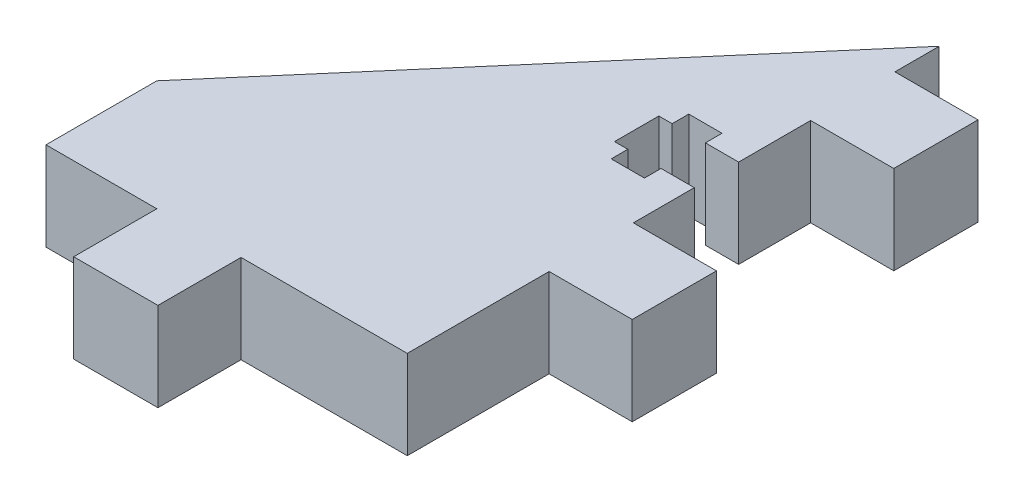
ISO-10303-21;
HEADER;
FILE_DESCRIPTION(('STEP AP214'),'2;1');
FILE_NAME('part.step','',(''),(''),'','','');
FILE_SCHEMA(('AUTOMOTIVE_DESIGN { 1 0 10303 214 1 1 1 1 }'));
ENDSEC;
DATA;
#1=APPLICATION_CONTEXT('core data for automotive mechanical design processes');
#2=APPLICATION_PROTOCOL_DEFINITION('international standard','automotive_design',2000,#1);
#3=PRODUCT_CONTEXT('',#1,'mechanical');
#4=PRODUCT('Part','Part','',(#3));
#5=PRODUCT_RELATED_PRODUCT_CATEGORY('part','',(#4));
#6=PRODUCT_DEFINITION_FORMATION('','',#4);
#7=PRODUCT_DEFINITION_CONTEXT('part definition',#1,'design');
#8=PRODUCT_DEFINITION('design','',#6,#7);
#9=PRODUCT_DEFINITION_SHAPE('','',#8);
#10=(LENGTH_UNIT() NAMED_UNIT(*) SI_UNIT(.MILLI.,.METRE.));
#11=(NAMED_UNIT(*) PLANE_ANGLE_UNIT() SI_UNIT($,.RADIAN.));
#12=(NAMED_UNIT(*) SI_UNIT($,.STERADIAN.) SOLID_ANGLE_UNIT());
#13=UNCERTAINTY_MEASURE_WITH_UNIT(LENGTH_MEASURE(1.E-05),#10,'distance_accuracy_value','');
#14=(GEOMETRIC_REPRESENTATION_CONTEXT(3) GLOBAL_UNCERTAINTY_ASSIGNED_CONTEXT((#13)) GLOBAL_UNIT_ASSIGNED_CONTEXT((#10,
#11,#12)) REPRESENTATION_CONTEXT('',''));
#15=CARTESIAN_POINT('',(0.,0.,0.));
#16=DIRECTION('',(0.,0.,1.));
#17=DIRECTION('',(1.,0.,0.));
#18=AXIS2_PLACEMENT_3D('',#15,#16,#17);
#19=CARTESIAN_POINT('',(0.,8.,-12.8));
#20=DIRECTION('',(-1.,0.,0.));
#21=DIRECTION('',(0.,0.,1.));
#22=AXIS2_PLACEMENT_3D('',#19,#20,#21);
#23=PLANE('',#22);
#24=DIRECTION('',(0.,0.,-1.));
#25=VECTOR('',#24,1.);
#26=CARTESIAN_POINT('',(0.,0.,-12.8));
#27=LINE('',#26,#25);
#28=CARTESIAN_POINT('',(0.,0.,0.));
#29=VERTEX_POINT('',#28);
#30=CARTESIAN_POINT('',(0.,0.,-12.8));
#31=VERTEX_POINT('',#30);
#32=EDGE_CURVE('E248',#29,#31,#27,.T.);
#33=ORIENTED_EDGE('',*,*,#32,.T.);
#34=DIRECTION('',(0.,-1.,0.));
#35=VECTOR('',#34,1.);
#36=CARTESIAN_POINT('',(0.,8.,-12.8));
#37=LINE('',#36,#35);
#38=CARTESIAN_POINT('',(0.,8.,-12.8));
#39=VERTEX_POINT('',#38);
#40=EDGE_CURVE('E11',#39,#31,#37,.T.);
#41=ORIENTED_EDGE('',*,*,#40,.F.);
#42=DIRECTION('',(0.,0.,-1.));
#43=VECTOR('',#42,1.);
#44=CARTESIAN_POINT('',(0.,8.,-12.8));
#45=LINE('',#44,#43);
#46=CARTESIAN_POINT('',(0.,8.,0.));
#47=VERTEX_POINT('',#46);
#48=EDGE_CURVE('E302',#47,#39,#45,.T.);
#49=ORIENTED_EDGE('',*,*,#48,.F.);
#50=DIRECTION('',(0.,-1.,0.));
#51=VECTOR('',#50,1.);
#52=CARTESIAN_POINT('',(0.,8.,0.));
#53=LINE('',#52,#51);
#54=EDGE_CURVE('E244',#47,#29,#53,.T.);
#55=ORIENTED_EDGE('',*,*,#54,.T.);
#56=EDGE_LOOP('',(#33,#41,#49,#55));
#57=FACE_BOUND('',#56,.T.);
#58=ADVANCED_FACE('F32',(#57),#23,.F.);
#59=CARTESIAN_POINT('',(7.5,8.,-12.8));
#60=DIRECTION('',(0.,0.,-1.));
#61=DIRECTION('',(-1.,0.,0.));
#62=AXIS2_PLACEMENT_3D('',#59,#60,#61);
#63=PLANE('',#62);
#64=DIRECTION('',(1.,0.,0.));
#65=VECTOR('',#64,1.);
#66=CARTESIAN_POINT('',(7.5,0.,-12.8));
#67=LINE('',#66,#65);
#68=CARTESIAN_POINT('',(7.5,0.,-12.8));
#69=VERTEX_POINT('',#68);
#70=EDGE_CURVE('E251',#31,#69,#67,.T.);
#71=ORIENTED_EDGE('',*,*,#70,.T.);
#72=DIRECTION('',(0.,-1.,0.));
#73=VECTOR('',#72,1.);
#74=CARTESIAN_POINT('',(7.5,8.,-12.8));
#75=LINE('',#74,#73);
#76=CARTESIAN_POINT('',(7.5,8.,-12.8));
#77=VERTEX_POINT('',#76);
#78=EDGE_CURVE('E40',#77,#69,#75,.T.);
#79=ORIENTED_EDGE('',*,*,#78,.F.);
#80=DIRECTION('',(1.,0.,0.));
#81=VECTOR('',#80,1.);
#82=CARTESIAN_POINT('',(7.5,8.,-12.8));
#83=LINE('',#82,#81);
#84=EDGE_CURVE('E151',#39,#77,#83,.T.);
#85=ORIENTED_EDGE('',*,*,#84,.F.);
#86=ORIENTED_EDGE('',*,*,#40,.T.);
#87=EDGE_LOOP('',(#71,#79,#85,#86));
#88=FACE_BOUND('',#87,.T.);
#89=ADVANCED_FACE('F460',(#88),#63,.F.);
#90=CARTESIAN_POINT('',(7.5,8.,-20.4));
#91=DIRECTION('',(-1.,0.,0.));
#92=DIRECTION('',(0.,0.,1.));
#93=AXIS2_PLACEMENT_3D('',#90,#91,#92);
#94=PLANE('',#93);
#95=DIRECTION('',(0.,0.,-1.));
#96=VECTOR('',#95,1.);
#97=CARTESIAN_POINT('',(7.5,0.,-20.4));
#98=LINE('',#97,#96);
#99=CARTESIAN_POINT('',(7.5,0.,-20.4));
#100=VERTEX_POINT('',#99);
#101=EDGE_CURVE('E253',#69,#100,#98,.T.);
#102=ORIENTED_EDGE('',*,*,#101,.T.);
#103=DIRECTION('',(0.,-1.,0.));
#104=VECTOR('',#103,1.);
#105=CARTESIAN_POINT('',(7.5,8.,-20.4));
#106=LINE('',#105,#104);
#107=CARTESIAN_POINT('',(7.5,8.,-20.4));
#108=VERTEX_POINT('',#107);
#109=EDGE_CURVE('E369',#108,#100,#106,.T.);
#110=ORIENTED_EDGE('',*,*,#109,.F.);
#111=DIRECTION('',(0.,0.,-1.));
#112=VECTOR('',#111,1.);
#113=CARTESIAN_POINT('',(7.5,8.,-20.4));
#114=LINE('',#113,#112);
#115=EDGE_CURVE('E377',#77,#108,#114,.T.);
#116=ORIENTED_EDGE('',*,*,#115,.F.);
#117=ORIENTED_EDGE('',*,*,#78,.T.);
#118=EDGE_LOOP('',(#102,#110,#116,#117));
#119=FACE_BOUND('',#118,.T.);
#120=ADVANCED_FACE('F375',(#119),#94,.F.);
#121=CARTESIAN_POINT('',(0.,8.,-20.4));
#122=DIRECTION('',(0.,0.,1.));
#123=DIRECTION('',(1.,0.,0.));
#124=AXIS2_PLACEMENT_3D('',#121,#122,#123);
#125=PLANE('',#124);
#126=DIRECTION('',(-1.,0.,0.));
#127=VECTOR('',#126,1.);
#128=CARTESIAN_POINT('',(0.,0.,-20.4));
#129=LINE('',#128,#127);
#130=CARTESIAN_POINT('',(0.,0.,-20.4));
#131=VERTEX_POINT('',#130);
#132=EDGE_CURVE('E255',#100,#131,#129,.T.);
#133=ORIENTED_EDGE('',*,*,#132,.T.);
#134=DIRECTION('',(0.,-1.,0.));
#135=VECTOR('',#134,1.);
#136=CARTESIAN_POINT('',(0.,8.,-20.4));
#137=LINE('',#136,#135);
#138=CARTESIAN_POINT('',(0.,8.,-20.4));
#139=VERTEX_POINT('',#138);
#140=EDGE_CURVE('E366',#139,#131,#137,.T.);
#141=ORIENTED_EDGE('',*,*,#140,.F.);
#142=DIRECTION('',(-1.,0.,0.));
#143=VECTOR('',#142,1.);
#144=CARTESIAN_POINT('',(0.,8.,-20.4));
#145=LINE('',#144,#143);
#146=EDGE_CURVE('E395',#108,#139,#145,.T.);
#147=ORIENTED_EDGE('',*,*,#146,.F.);
#148=ORIENTED_EDGE('',*,*,#109,.T.);
#149=EDGE_LOOP('',(#133,#141,#147,#148));
#150=FACE_BOUND('',#149,.T.);
#151=ADVANCED_FACE('F386',(#150),#125,.F.);
#152=CARTESIAN_POINT('',(0.,8.,-25.9));
#153=DIRECTION('',(-1.,0.,0.));
#154=DIRECTION('',(0.,0.,1.));
#155=AXIS2_PLACEMENT_3D('',#152,#153,#154);
#156=PLANE('',#155);
#157=DIRECTION('',(0.,0.,-1.));
#158=VECTOR('',#157,1.);
#159=CARTESIAN_POINT('',(0.,0.,-25.9));
#160=LINE('',#159,#158);
#161=CARTESIAN_POINT('',(0.,0.,-25.9));
#162=VERTEX_POINT('',#161);
#163=EDGE_CURVE('E257',#131,#162,#160,.T.);
#164=ORIENTED_EDGE('',*,*,#163,.T.);
#165=DIRECTION('',(0.,-1.,0.));
#166=VECTOR('',#165,1.);
#167=CARTESIAN_POINT('',(0.,8.,-25.9));
#168=LINE('',#167,#166);
#169=CARTESIAN_POINT('',(0.,8.,-25.9));
#170=VERTEX_POINT('',#169);
#171=EDGE_CURVE('E363',#170,#162,#168,.T.);
#172=ORIENTED_EDGE('',*,*,#171,.F.);
#173=DIRECTION('',(0.,0.,-1.));
#174=VECTOR('',#173,1.);
#175=CARTESIAN_POINT('',(0.,8.,-25.9));
#176=LINE('',#175,#174);
#177=EDGE_CURVE('E392',#139,#170,#176,.T.);
#178=ORIENTED_EDGE('',*,*,#177,.F.);
#179=ORIENTED_EDGE('',*,*,#140,.T.);
#180=EDGE_LOOP('',(#164,#172,#178,#179));
#181=FACE_BOUND('',#180,.T.);
#182=ADVANCED_FACE('F390',(#181),#156,.F.);
#183=CARTESIAN_POINT('',(-3.,8.,-25.9));
#184=DIRECTION('',(0.,0.,1.));
#185=DIRECTION('',(1.,0.,0.));
#186=AXIS2_PLACEMENT_3D('',#183,#184,#185);
#187=PLANE('',#186);
#188=DIRECTION('',(-1.,0.,0.));
#189=VECTOR('',#188,1.);
#190=CARTESIAN_POINT('',(-3.,0.,-25.9));
#191=LINE('',#190,#189);
#192=CARTESIAN_POINT('',(-3.,0.,-25.9));
#193=VERTEX_POINT('',#192);
#194=EDGE_CURVE('E259',#162,#193,#191,.T.);
#195=ORIENTED_EDGE('',*,*,#194,.T.);
#196=DIRECTION('',(0.,-1.,0.));
#197=VECTOR('',#196,1.);
#198=CARTESIAN_POINT('',(-3.,8.,-25.9));
#199=LINE('',#198,#197);
#200=CARTESIAN_POINT('',(-3.,8.,-25.9));
#201=VERTEX_POINT('',#200);
#202=EDGE_CURVE('E360',#201,#193,#199,.T.);
#203=ORIENTED_EDGE('',*,*,#202,.F.);
#204=DIRECTION('',(-1.,0.,0.));
#205=VECTOR('',#204,1.);
#206=CARTESIAN_POINT('',(-3.,8.,-25.9));
#207=LINE('',#206,#205);
#208=EDGE_CURVE('E394',#170,#201,#207,.T.);
#209=ORIENTED_EDGE('',*,*,#208,.F.);
#210=ORIENTED_EDGE('',*,*,#171,.T.);
#211=EDGE_LOOP('',(#195,#203,#209,#210));
#212=FACE_BOUND('',#211,.T.);
#213=ADVANCED_FACE('F473',(#212),#187,.F.);
#214=CARTESIAN_POINT('',(-3.,8.,-24.4));
#215=DIRECTION('',(1.,0.,0.));
#216=DIRECTION('',(0.,0.,-1.));
#217=AXIS2_PLACEMENT_3D('',#214,#215,#216);
#218=PLANE('',#217);
#219=DIRECTION('',(0.,0.,1.));
#220=VECTOR('',#219,1.);
#221=CARTESIAN_POINT('',(-3.,0.,-24.4));
#222=LINE('',#221,#220);
#223=CARTESIAN_POINT('',(-3.,0.,-24.4));
#224=VERTEX_POINT('',#223);
#225=EDGE_CURVE('E261',#193,#224,#222,.T.);
#226=ORIENTED_EDGE('',*,*,#225,.T.);
#227=DIRECTION('',(0.,-1.,0.));
#228=VECTOR('',#227,1.);
#229=CARTESIAN_POINT('',(-3.,8.,-24.4));
#230=LINE('',#229,#228);
#231=CARTESIAN_POINT('',(-3.,8.,-24.4));
#232=VERTEX_POINT('',#231);
#233=EDGE_CURVE('E357',#232,#224,#230,.T.);
#234=ORIENTED_EDGE('',*,*,#233,.F.);
#235=DIRECTION('',(0.,0.,1.));
#236=VECTOR('',#235,1.);
#237=CARTESIAN_POINT('',(-3.,8.,-24.4));
#238=LINE('',#237,#236);
#239=EDGE_CURVE('E397',#201,#232,#238,.T.);
#240=ORIENTED_EDGE('',*,*,#239,.F.);
#241=ORIENTED_EDGE('',*,*,#202,.T.);
#242=EDGE_LOOP('',(#226,#234,#240,#241));
#243=FACE_BOUND('',#242,.T.);
#244=ADVANCED_FACE('F476',(#243),#218,.F.);
#245=CARTESIAN_POINT('',(-6.,8.,-24.4));
#246=DIRECTION('',(0.,0.,1.));
#247=DIRECTION('',(1.,0.,0.));
#248=AXIS2_PLACEMENT_3D('',#245,#246,#247);
#249=PLANE('',#248);
#250=DIRECTION('',(-1.,0.,0.));
#251=VECTOR('',#250,1.);
#252=CARTESIAN_POINT('',(-6.,0.,-24.4));
#253=LINE('',#252,#251);
#254=CARTESIAN_POINT('',(-6.,0.,-24.4));
#255=VERTEX_POINT('',#254);
#256=EDGE_CURVE('E263',#224,#255,#253,.T.);
#257=ORIENTED_EDGE('',*,*,#256,.T.);
#258=DIRECTION('',(0.,-1.,0.));
#259=VECTOR('',#258,1.);
#260=CARTESIAN_POINT('',(-6.,8.,-24.4));
#261=LINE('',#260,#259);
#262=CARTESIAN_POINT('',(-6.,8.,-24.4));
#263=VERTEX_POINT('',#262);
#264=EDGE_CURVE('E354',#263,#255,#261,.T.);
#265=ORIENTED_EDGE('',*,*,#264,.F.);
#266=DIRECTION('',(-1.,0.,0.));
#267=VECTOR('',#266,1.);
#268=CARTESIAN_POINT('',(-6.,8.,-24.4));
#269=LINE('',#268,#267);
#270=EDGE_CURVE('E403',#232,#263,#269,.T.);
#271=ORIENTED_EDGE('',*,*,#270,.F.);
#272=ORIENTED_EDGE('',*,*,#233,.T.);
#273=EDGE_LOOP('',(#257,#265,#271,#272));
#274=FACE_BOUND('',#273,.T.);
#275=ADVANCED_FACE('F480',(#274),#249,.F.);
#276=CARTESIAN_POINT('',(-6.,8.,-25.9));
#277=DIRECTION('',(-1.,0.,0.));
#278=DIRECTION('',(0.,0.,1.));
#279=AXIS2_PLACEMENT_3D('',#276,#277,#278);
#280=PLANE('',#279);
#281=DIRECTION('',(0.,0.,-1.));
#282=VECTOR('',#281,1.);
#283=CARTESIAN_POINT('',(-6.,0.,-25.9));
#284=LINE('',#283,#282);
#285=CARTESIAN_POINT('',(-6.,0.,-25.9));
#286=VERTEX_POINT('',#285);
#287=EDGE_CURVE('E265',#255,#286,#284,.T.);
#288=ORIENTED_EDGE('',*,*,#287,.T.);
#289=DIRECTION('',(0.,-1.,0.));
#290=VECTOR('',#289,1.);
#291=CARTESIAN_POINT('',(-6.,8.,-25.9));
#292=LINE('',#291,#290);
#293=CARTESIAN_POINT('',(-6.,8.,-25.9));
#294=VERTEX_POINT('',#293);
#295=EDGE_CURVE('E351',#294,#286,#292,.T.);
#296=ORIENTED_EDGE('',*,*,#295,.F.);
#297=DIRECTION('',(0.,0.,-1.));
#298=VECTOR('',#297,1.);
#299=CARTESIAN_POINT('',(-6.,8.,-25.9));
#300=LINE('',#299,#298);
#301=EDGE_CURVE('E405',#263,#294,#300,.T.);
#302=ORIENTED_EDGE('',*,*,#301,.F.);
#303=ORIENTED_EDGE('',*,*,#264,.T.);
#304=EDGE_LOOP('',(#288,#296,#302,#303));
#305=FACE_BOUND('',#304,.T.);
#306=ADVANCED_FACE('F484',(#305),#280,.F.);
#307=CARTESIAN_POINT('',(-7.2,8.,-25.9));
#308=DIRECTION('',(0.,0.,1.));
#309=DIRECTION('',(1.,0.,0.));
#310=AXIS2_PLACEMENT_3D('',#307,#308,#309);
#311=PLANE('',#310);
#312=DIRECTION('',(-1.,0.,0.));
#313=VECTOR('',#312,1.);
#314=CARTESIAN_POINT('',(-7.2,0.,-25.9));
#315=LINE('',#314,#313);
#316=CARTESIAN_POINT('',(-7.2,0.,-25.9));
#317=VERTEX_POINT('',#316);
#318=EDGE_CURVE('E267',#286,#317,#315,.T.);
#319=ORIENTED_EDGE('',*,*,#318,.T.);
#320=DIRECTION('',(0.,-1.,0.));
#321=VECTOR('',#320,1.);
#322=CARTESIAN_POINT('',(-7.2,8.,-25.9));
#323=LINE('',#322,#321);
#324=CARTESIAN_POINT('',(-7.2,8.,-25.9));
#325=VERTEX_POINT('',#324);
#326=EDGE_CURVE('E348',#325,#317,#323,.T.);
#327=ORIENTED_EDGE('',*,*,#326,.F.);
#328=DIRECTION('',(-1.,0.,0.));
#329=VECTOR('',#328,1.);
#330=CARTESIAN_POINT('',(-7.2,8.,-25.9));
#331=LINE('',#330,#329);
#332=EDGE_CURVE('E407',#294,#325,#331,.T.);
#333=ORIENTED_EDGE('',*,*,#332,.F.);
#334=ORIENTED_EDGE('',*,*,#295,.T.);
#335=EDGE_LOOP('',(#319,#327,#333,#334));
#336=FACE_BOUND('',#335,.T.);
#337=ADVANCED_FACE('F488',(#336),#311,.F.);
#338=CARTESIAN_POINT('',(-7.2,8.,-29.9));
#339=DIRECTION('',(-1.,0.,0.));
#340=DIRECTION('',(0.,0.,1.));
#341=AXIS2_PLACEMENT_3D('',#338,#339,#340);
#342=PLANE('',#341);
#343=DIRECTION('',(0.,0.,-1.));
#344=VECTOR('',#343,1.);
#345=CARTESIAN_POINT('',(-7.2,0.,-29.9));
#346=LINE('',#345,#344);
#347=CARTESIAN_POINT('',(-7.2,0.,-29.9));
#348=VERTEX_POINT('',#347);
#349=EDGE_CURVE('E269',#317,#348,#346,.T.);
#350=ORIENTED_EDGE('',*,*,#349,.T.);
#351=DIRECTION('',(0.,-1.,0.));
#352=VECTOR('',#351,1.);
#353=CARTESIAN_POINT('',(-7.2,8.,-29.9));
#354=LINE('',#353,#352);
#355=CARTESIAN_POINT('',(-7.2,8.,-29.9));
#356=VERTEX_POINT('',#355);
#357=EDGE_CURVE('E345',#356,#348,#354,.T.);
#358=ORIENTED_EDGE('',*,*,#357,.F.);
#359=DIRECTION('',(0.,0.,-1.));
#360=VECTOR('',#359,1.);
#361=CARTESIAN_POINT('',(-7.2,8.,-29.9));
#362=LINE('',#361,#360);
#363=EDGE_CURVE('E409',#325,#356,#362,.T.);
#364=ORIENTED_EDGE('',*,*,#363,.F.);
#365=ORIENTED_EDGE('',*,*,#326,.T.);
#366=EDGE_LOOP('',(#350,#358,#364,#365));
#367=FACE_BOUND('',#366,.T.);
#368=ADVANCED_FACE('F492',(#367),#342,.F.);
#369=CARTESIAN_POINT('',(-6.,8.,-29.9));
#370=DIRECTION('',(0.,0.,-1.));
#371=DIRECTION('',(-1.,0.,0.));
#372=AXIS2_PLACEMENT_3D('',#369,#370,#371);
#373=PLANE('',#372);
#374=DIRECTION('',(1.,0.,0.));
#375=VECTOR('',#374,1.);
#376=CARTESIAN_POINT('',(-6.,0.,-29.9));
#377=LINE('',#376,#375);
#378=CARTESIAN_POINT('',(-6.,0.,-29.9));
#379=VERTEX_POINT('',#378);
#380=EDGE_CURVE('E271',#348,#379,#377,.T.);
#381=ORIENTED_EDGE('',*,*,#380,.T.);
#382=DIRECTION('',(0.,-1.,0.));
#383=VECTOR('',#382,1.);
#384=CARTESIAN_POINT('',(-6.,8.,-29.9));
#385=LINE('',#384,#383);
#386=CARTESIAN_POINT('',(-6.,8.,-29.9));
#387=VERTEX_POINT('',#386);
#388=EDGE_CURVE('E342',#387,#379,#385,.T.);
#389=ORIENTED_EDGE('',*,*,#388,.F.);
#390=DIRECTION('',(1.,0.,0.));
#391=VECTOR('',#390,1.);
#392=CARTESIAN_POINT('',(-6.,8.,-29.9));
#393=LINE('',#392,#391);
#394=EDGE_CURVE('E411',#356,#387,#393,.T.);
#395=ORIENTED_EDGE('',*,*,#394,.F.);
#396=ORIENTED_EDGE('',*,*,#357,.T.);
#397=EDGE_LOOP('',(#381,#389,#395,#396));
#398=FACE_BOUND('',#397,.T.);
#399=ADVANCED_FACE('F496',(#398),#373,.F.);
#400=CARTESIAN_POINT('',(-6.,8.,-31.4));
#401=DIRECTION('',(-1.,0.,0.));
#402=DIRECTION('',(0.,0.,1.));
#403=AXIS2_PLACEMENT_3D('',#400,#401,#402);
#404=PLANE('',#403);
#405=DIRECTION('',(0.,0.,-1.));
#406=VECTOR('',#405,1.);
#407=CARTESIAN_POINT('',(-6.,0.,-31.4));
#408=LINE('',#407,#406);
#409=CARTESIAN_POINT('',(-6.,0.,-31.4));
#410=VERTEX_POINT('',#409);
#411=EDGE_CURVE('E273',#379,#410,#408,.T.);
#412=ORIENTED_EDGE('',*,*,#411,.T.);
#413=DIRECTION('',(0.,-1.,0.));
#414=VECTOR('',#413,1.);
#415=CARTESIAN_POINT('',(-6.,8.,-31.4));
#416=LINE('',#415,#414);
#417=CARTESIAN_POINT('',(-6.,8.,-31.4));
#418=VERTEX_POINT('',#417);
#419=EDGE_CURVE('E339',#418,#410,#416,.T.);
#420=ORIENTED_EDGE('',*,*,#419,.F.);
#421=DIRECTION('',(0.,0.,-1.));
#422=VECTOR('',#421,1.);
#423=CARTESIAN_POINT('',(-6.,8.,-31.4));
#424=LINE('',#423,#422);
#425=EDGE_CURVE('E413',#387,#418,#424,.T.);
#426=ORIENTED_EDGE('',*,*,#425,.F.);
#427=ORIENTED_EDGE('',*,*,#388,.T.);
#428=EDGE_LOOP('',(#412,#420,#426,#427));
#429=FACE_BOUND('',#428,.T.);
#430=ADVANCED_FACE('F500',(#429),#404,.F.);
#431=CARTESIAN_POINT('',(-3.,8.,-31.4));
#432=DIRECTION('',(0.,0.,-1.));
#433=DIRECTION('',(-1.,0.,0.));
#434=AXIS2_PLACEMENT_3D('',#431,#432,#433);
#435=PLANE('',#434);
#436=DIRECTION('',(1.,0.,0.));
#437=VECTOR('',#436,1.);
#438=CARTESIAN_POINT('',(-3.,0.,-31.4));
#439=LINE('',#438,#437);
#440=CARTESIAN_POINT('',(-3.,0.,-31.4));
#441=VERTEX_POINT('',#440);
#442=EDGE_CURVE('E275',#410,#441,#439,.T.);
#443=ORIENTED_EDGE('',*,*,#442,.T.);
#444=DIRECTION('',(0.,-1.,0.));
#445=VECTOR('',#444,1.);
#446=CARTESIAN_POINT('',(-3.,8.,-31.4));
#447=LINE('',#446,#445);
#448=CARTESIAN_POINT('',(-3.,8.,-31.4));
#449=VERTEX_POINT('',#448);
#450=EDGE_CURVE('E336',#449,#441,#447,.T.);
#451=ORIENTED_EDGE('',*,*,#450,.F.);
#452=DIRECTION('',(1.,0.,0.));
#453=VECTOR('',#452,1.);
#454=CARTESIAN_POINT('',(-3.,8.,-31.4));
#455=LINE('',#454,#453);
#456=EDGE_CURVE('E415',#418,#449,#455,.T.);
#457=ORIENTED_EDGE('',*,*,#456,.F.);
#458=ORIENTED_EDGE('',*,*,#419,.T.);
#459=EDGE_LOOP('',(#443,#451,#457,#458));
#460=FACE_BOUND('',#459,.T.);
#461=ADVANCED_FACE('F504',(#460),#435,.F.);
#462=CARTESIAN_POINT('',(-3.,8.,-29.9));
#463=DIRECTION('',(1.,0.,0.));
#464=DIRECTION('',(0.,0.,-1.));
#465=AXIS2_PLACEMENT_3D('',#462,#463,#464);
#466=PLANE('',#465);
#467=DIRECTION('',(0.,0.,1.));
#468=VECTOR('',#467,1.);
#469=CARTESIAN_POINT('',(-3.,0.,-29.9));
#470=LINE('',#469,#468);
#471=CARTESIAN_POINT('',(-3.,0.,-29.9));
#472=VERTEX_POINT('',#471);
#473=EDGE_CURVE('E277',#441,#472,#470,.T.);
#474=ORIENTED_EDGE('',*,*,#473,.T.);
#475=DIRECTION('',(0.,-1.,0.));
#476=VECTOR('',#475,1.);
#477=CARTESIAN_POINT('',(-3.,8.,-29.9));
#478=LINE('',#477,#476);
#479=CARTESIAN_POINT('',(-3.,8.,-29.9));
#480=VERTEX_POINT('',#479);
#481=EDGE_CURVE('E333',#480,#472,#478,.T.);
#482=ORIENTED_EDGE('',*,*,#481,.F.);
#483=DIRECTION('',(0.,0.,1.));
#484=VECTOR('',#483,1.);
#485=CARTESIAN_POINT('',(-3.,8.,-29.9));
#486=LINE('',#485,#484);
#487=EDGE_CURVE('E417',#449,#480,#486,.T.);
#488=ORIENTED_EDGE('',*,*,#487,.F.);
#489=ORIENTED_EDGE('',*,*,#450,.T.);
#490=EDGE_LOOP('',(#474,#482,#488,#489));
#491=FACE_BOUND('',#490,.T.);
#492=ADVANCED_FACE('F508',(#491),#466,.F.);
#493=CARTESIAN_POINT('',(0.,8.,-29.9));
#494=DIRECTION('',(0.,0.,-1.));
#495=DIRECTION('',(-1.,0.,0.));
#496=AXIS2_PLACEMENT_3D('',#493,#494,#495);
#497=PLANE('',#496);
#498=DIRECTION('',(1.,0.,0.));
#499=VECTOR('',#498,1.);
#500=CARTESIAN_POINT('',(0.,0.,-29.9));
#501=LINE('',#500,#499);
#502=CARTESIAN_POINT('',(0.,0.,-29.9));
#503=VERTEX_POINT('',#502);
#504=EDGE_CURVE('E279',#472,#503,#501,.T.);
#505=ORIENTED_EDGE('',*,*,#504,.T.);
#506=DIRECTION('',(0.,-1.,0.));
#507=VECTOR('',#506,1.);
#508=CARTESIAN_POINT('',(0.,8.,-29.9));
#509=LINE('',#508,#507);
#510=CARTESIAN_POINT('',(0.,8.,-29.9));
#511=VERTEX_POINT('',#510);
#512=EDGE_CURVE('E330',#511,#503,#509,.T.);
#513=ORIENTED_EDGE('',*,*,#512,.F.);
#514=DIRECTION('',(1.,0.,0.));
#515=VECTOR('',#514,1.);
#516=CARTESIAN_POINT('',(0.,8.,-29.9));
#517=LINE('',#516,#515);
#518=EDGE_CURVE('E419',#480,#511,#517,.T.);
#519=ORIENTED_EDGE('',*,*,#518,.F.);
#520=ORIENTED_EDGE('',*,*,#481,.T.);
#521=EDGE_LOOP('',(#505,#513,#519,#520));
#522=FACE_BOUND('',#521,.T.);
#523=ADVANCED_FACE('F512',(#522),#497,.F.);
#524=CARTESIAN_POINT('',(0.,8.,-36.4));
#525=DIRECTION('',(-1.,0.,0.));
#526=DIRECTION('',(0.,0.,1.));
#527=AXIS2_PLACEMENT_3D('',#524,#525,#526);
#528=PLANE('',#527);
#529=DIRECTION('',(0.,0.,-1.));
#530=VECTOR('',#529,1.);
#531=CARTESIAN_POINT('',(0.,0.,-36.4));
#532=LINE('',#531,#530);
#533=CARTESIAN_POINT('',(0.,0.,-36.4));
#534=VERTEX_POINT('',#533);
#535=EDGE_CURVE('E281',#503,#534,#532,.T.);
#536=ORIENTED_EDGE('',*,*,#535,.T.);
#537=DIRECTION('',(0.,-1.,0.));
#538=VECTOR('',#537,1.);
#539=CARTESIAN_POINT('',(0.,8.,-36.4));
#540=LINE('',#539,#538);
#541=CARTESIAN_POINT('',(0.,8.,-36.4));
#542=VERTEX_POINT('',#541);
#543=EDGE_CURVE('E327',#542,#534,#540,.T.);
#544=ORIENTED_EDGE('',*,*,#543,.F.);
#545=DIRECTION('',(0.,0.,-1.));
#546=VECTOR('',#545,1.);
#547=CARTESIAN_POINT('',(0.,8.,-36.4));
#548=LINE('',#547,#546);
#549=EDGE_CURVE('E421',#511,#542,#548,.T.);
#550=ORIENTED_EDGE('',*,*,#549,.F.);
#551=ORIENTED_EDGE('',*,*,#512,.T.);
#552=EDGE_LOOP('',(#536,#544,#550,#551));
#553=FACE_BOUND('',#552,.T.);
#554=ADVANCED_FACE('F516',(#553),#528,.F.);
#555=CARTESIAN_POINT('',(7.5,8.,-36.4));
#556=DIRECTION('',(0.,0.,-1.));
#557=DIRECTION('',(-1.,0.,0.));
#558=AXIS2_PLACEMENT_3D('',#555,#556,#557);
#559=PLANE('',#558);
#560=DIRECTION('',(1.,0.,0.));
#561=VECTOR('',#560,1.);
#562=CARTESIAN_POINT('',(7.5,0.,-36.4));
#563=LINE('',#562,#561);
#564=CARTESIAN_POINT('',(7.5,0.,-36.4));
#565=VERTEX_POINT('',#564);
#566=EDGE_CURVE('E283',#534,#565,#563,.T.);
#567=ORIENTED_EDGE('',*,*,#566,.T.);
#568=DIRECTION('',(0.,-1.,0.));
#569=VECTOR('',#568,1.);
#570=CARTESIAN_POINT('',(7.5,8.,-36.4));
#571=LINE('',#570,#569);
#572=CARTESIAN_POINT('',(7.5,8.,-36.4));
#573=VERTEX_POINT('',#572);
#574=EDGE_CURVE('E324',#573,#565,#571,.T.);
#575=ORIENTED_EDGE('',*,*,#574,.F.);
#576=DIRECTION('',(1.,0.,0.));
#577=VECTOR('',#576,1.);
#578=CARTESIAN_POINT('',(7.5,8.,-36.4));
#579=LINE('',#578,#577);
#580=EDGE_CURVE('E423',#542,#573,#579,.T.);
#581=ORIENTED_EDGE('',*,*,#580,.F.);
#582=ORIENTED_EDGE('',*,*,#543,.T.);
#583=EDGE_LOOP('',(#567,#575,#581,#582));
#584=FACE_BOUND('',#583,.T.);
#585=ADVANCED_FACE('F520',(#584),#559,.F.);
#586=CARTESIAN_POINT('',(7.5,8.,-44.));
#587=DIRECTION('',(-1.,0.,0.));
#588=DIRECTION('',(0.,0.,1.));
#589=AXIS2_PLACEMENT_3D('',#586,#587,#588);
#590=PLANE('',#589);
#591=DIRECTION('',(0.,0.,-1.));
#592=VECTOR('',#591,1.);
#593=CARTESIAN_POINT('',(7.5,0.,-44.));
#594=LINE('',#593,#592);
#595=CARTESIAN_POINT('',(7.5,0.,-44.));
#596=VERTEX_POINT('',#595);
#597=EDGE_CURVE('E285',#565,#596,#594,.T.);
#598=ORIENTED_EDGE('',*,*,#597,.T.);
#599=DIRECTION('',(0.,-1.,0.));
#600=VECTOR('',#599,1.);
#601=CARTESIAN_POINT('',(7.5,8.,-44.));
#602=LINE('',#601,#600);
#603=CARTESIAN_POINT('',(7.5,8.,-44.));
#604=VERTEX_POINT('',#603);
#605=EDGE_CURVE('E321',#604,#596,#602,.T.);
#606=ORIENTED_EDGE('',*,*,#605,.F.);
#607=DIRECTION('',(0.,0.,-1.));
#608=VECTOR('',#607,1.);
#609=CARTESIAN_POINT('',(7.5,8.,-44.));
#610=LINE('',#609,#608);
#611=EDGE_CURVE('E425',#573,#604,#610,.T.);
#612=ORIENTED_EDGE('',*,*,#611,.F.);
#613=ORIENTED_EDGE('',*,*,#574,.T.);
#614=EDGE_LOOP('',(#598,#606,#612,#613));
#615=FACE_BOUND('',#614,.T.);
#616=ADVANCED_FACE('F524',(#615),#590,.F.);
#617=CARTESIAN_POINT('',(0.,8.,-44.));
#618=DIRECTION('',(0.,0.,1.));
#619=DIRECTION('',(1.,0.,0.));
#620=AXIS2_PLACEMENT_3D('',#617,#618,#619);
#621=PLANE('',#620);
#622=DIRECTION('',(-1.,0.,0.));
#623=VECTOR('',#622,1.);
#624=CARTESIAN_POINT('',(0.,0.,-44.));
#625=LINE('',#624,#623);
#626=CARTESIAN_POINT('',(0.,0.,-44.));
#627=VERTEX_POINT('',#626);
#628=EDGE_CURVE('E287',#596,#627,#625,.T.);
#629=ORIENTED_EDGE('',*,*,#628,.T.);
#630=DIRECTION('',(0.,-1.,0.));
#631=VECTOR('',#630,1.);
#632=CARTESIAN_POINT('',(0.,8.,-44.));
#633=LINE('',#632,#631);
#634=CARTESIAN_POINT('',(0.,8.,-44.));
#635=VERTEX_POINT('',#634);
#636=EDGE_CURVE('E318',#635,#627,#633,.T.);
#637=ORIENTED_EDGE('',*,*,#636,.F.);
#638=DIRECTION('',(-1.,0.,0.));
#639=VECTOR('',#638,1.);
#640=CARTESIAN_POINT('',(0.,8.,-44.));
#641=LINE('',#640,#639);
#642=EDGE_CURVE('E427',#604,#635,#641,.T.);
#643=ORIENTED_EDGE('',*,*,#642,.F.);
#644=ORIENTED_EDGE('',*,*,#605,.T.);
#645=EDGE_LOOP('',(#629,#637,#643,#644));
#646=FACE_BOUND('',#645,.T.);
#647=ADVANCED_FACE('F528',(#646),#621,.F.);
#648=CARTESIAN_POINT('',(0.,8.,-48.));
#649=DIRECTION('',(-1.,0.,0.));
#650=DIRECTION('',(0.,0.,1.));
#651=AXIS2_PLACEMENT_3D('',#648,#649,#650);
#652=PLANE('',#651);
#653=DIRECTION('',(0.,0.,-1.));
#654=VECTOR('',#653,1.);
#655=CARTESIAN_POINT('',(0.,0.,-48.));
#656=LINE('',#655,#654);
#657=CARTESIAN_POINT('',(0.,0.,-48.));
#658=VERTEX_POINT('',#657);
#659=EDGE_CURVE('E289',#627,#658,#656,.T.);
#660=ORIENTED_EDGE('',*,*,#659,.T.);
#661=DIRECTION('',(0.,-1.,0.));
#662=VECTOR('',#661,1.);
#663=CARTESIAN_POINT('',(0.,8.,-48.));
#664=LINE('',#663,#662);
#665=CARTESIAN_POINT('',(0.,8.,-48.));
#666=VERTEX_POINT('',#665);
#667=EDGE_CURVE('E315',#666,#658,#664,.T.);
#668=ORIENTED_EDGE('',*,*,#667,.F.);
#669=DIRECTION('',(0.,0.,-1.));
#670=VECTOR('',#669,1.);
#671=CARTESIAN_POINT('',(0.,8.,-48.));
#672=LINE('',#671,#670);
#673=EDGE_CURVE('E429',#635,#666,#672,.T.);
#674=ORIENTED_EDGE('',*,*,#673,.F.);
#675=ORIENTED_EDGE('',*,*,#636,.T.);
#676=EDGE_LOOP('',(#660,#668,#674,#675));
#677=FACE_BOUND('',#676,.T.);
#678=ADVANCED_FACE('F532',(#677),#652,.F.);
#679=CARTESIAN_POINT('',(-32.6,8.,-10.));
#680=DIRECTION('',(0.758974559126123,0.,0.651120279671358));
#681=DIRECTION('',(0.651120279671358,0.,-0.758974559126123));
#682=AXIS2_PLACEMENT_3D('',#679,#680,#681);
#683=PLANE('',#682);
#684=DIRECTION('',(-0.651120279671358,0.,0.758974559126123));
#685=VECTOR('',#684,1.);
#686=CARTESIAN_POINT('',(-32.6,0.,-10.));
#687=LINE('',#686,#685);
#688=CARTESIAN_POINT('',(-32.6,0.,-10.));
#689=VERTEX_POINT('',#688);
#690=EDGE_CURVE('E291',#658,#689,#687,.T.);
#691=ORIENTED_EDGE('',*,*,#690,.T.);
#692=DIRECTION('',(0.,-1.,0.));
#693=VECTOR('',#692,1.);
#694=CARTESIAN_POINT('',(-32.6,8.,-10.));
#695=LINE('',#694,#693);
#696=CARTESIAN_POINT('',(-32.6,8.,-10.));
#697=VERTEX_POINT('',#696);
#698=EDGE_CURVE('E312',#697,#689,#695,.T.);
#699=ORIENTED_EDGE('',*,*,#698,.F.);
#700=DIRECTION('',(-0.651120279671358,0.,0.758974559126123));
#701=VECTOR('',#700,1.);
#702=CARTESIAN_POINT('',(-32.6,8.,-10.));
#703=LINE('',#702,#701);
#704=EDGE_CURVE('E431',#666,#697,#703,.T.);
#705=ORIENTED_EDGE('',*,*,#704,.F.);
#706=ORIENTED_EDGE('',*,*,#667,.T.);
#707=EDGE_LOOP('',(#691,#699,#705,#706));
#708=FACE_BOUND('',#707,.T.);
#709=ADVANCED_FACE('F536',(#708),#683,.F.);
#710=CARTESIAN_POINT('',(-32.6,8.,0.));
#711=DIRECTION('',(1.,0.,0.));
#712=DIRECTION('',(0.,0.,-1.));
#713=AXIS2_PLACEMENT_3D('',#710,#711,#712);
#714=PLANE('',#713);
#715=DIRECTION('',(0.,0.,1.));
#716=VECTOR('',#715,1.);
#717=CARTESIAN_POINT('',(-32.6,0.,0.));
#718=LINE('',#717,#716);
#719=CARTESIAN_POINT('',(-32.6,0.,0.));
#720=VERTEX_POINT('',#719);
#721=EDGE_CURVE('E293',#689,#720,#718,.T.);
#722=ORIENTED_EDGE('',*,*,#721,.T.);
#723=DIRECTION('',(0.,-1.,0.));
#724=VECTOR('',#723,1.);
#725=CARTESIAN_POINT('',(-32.6,8.,0.));
#726=LINE('',#725,#724);
#727=CARTESIAN_POINT('',(-32.6,8.,0.));
#728=VERTEX_POINT('',#727);
#729=EDGE_CURVE('E309',#728,#720,#726,.T.);
#730=ORIENTED_EDGE('',*,*,#729,.F.);
#731=DIRECTION('',(0.,0.,1.));
#732=VECTOR('',#731,1.);
#733=CARTESIAN_POINT('',(-32.6,8.,0.));
#734=LINE('',#733,#732);
#735=EDGE_CURVE('E433',#697,#728,#734,.T.);
#736=ORIENTED_EDGE('',*,*,#735,.F.);
#737=ORIENTED_EDGE('',*,*,#698,.T.);
#738=EDGE_LOOP('',(#722,#730,#736,#737));
#739=FACE_BOUND('',#738,.T.);
#740=ADVANCED_FACE('F540',(#739),#714,.F.);
#741=CARTESIAN_POINT('',(-22.6,8.,0.));
#742=DIRECTION('',(0.,0.,-1.));
#743=DIRECTION('',(-1.,0.,0.));
#744=AXIS2_PLACEMENT_3D('',#741,#742,#743);
#745=PLANE('',#744);
#746=DIRECTION('',(1.,0.,0.));
#747=VECTOR('',#746,1.);
#748=CARTESIAN_POINT('',(-22.6,0.,0.));
#749=LINE('',#748,#747);
#750=CARTESIAN_POINT('',(-22.6,0.,0.));
#751=VERTEX_POINT('',#750);
#752=EDGE_CURVE('E295',#720,#751,#749,.T.);
#753=ORIENTED_EDGE('',*,*,#752,.T.);
#754=DIRECTION('',(0.,-1.,0.));
#755=VECTOR('',#754,1.);
#756=CARTESIAN_POINT('',(-22.6,8.,0.));
#757=LINE('',#756,#755);
#758=CARTESIAN_POINT('',(-22.6,8.,0.));
#759=VERTEX_POINT('',#758);
#760=EDGE_CURVE('E306',#759,#751,#757,.T.);
#761=ORIENTED_EDGE('',*,*,#760,.F.);
#762=DIRECTION('',(1.,0.,0.));
#763=VECTOR('',#762,1.);
#764=CARTESIAN_POINT('',(-22.6,8.,0.));
#765=LINE('',#764,#763);
#766=EDGE_CURVE('E435',#728,#759,#765,.T.);
#767=ORIENTED_EDGE('',*,*,#766,.F.);
#768=ORIENTED_EDGE('',*,*,#729,.T.);
#769=EDGE_LOOP('',(#753,#761,#767,#768));
#770=FACE_BOUND('',#769,.T.);
#771=ADVANCED_FACE('F441',(#770),#745,.F.);
#772=CARTESIAN_POINT('',(-22.6,8.,7.5));
#773=DIRECTION('',(1.,0.,0.));
#774=DIRECTION('',(0.,0.,-1.));
#775=AXIS2_PLACEMENT_3D('',#772,#773,#774);
#776=PLANE('',#775);
#777=DIRECTION('',(0.,0.,1.));
#778=VECTOR('',#777,1.);
#779=CARTESIAN_POINT('',(-22.6,0.,7.5));
#780=LINE('',#779,#778);
#781=CARTESIAN_POINT('',(-22.6,0.,7.5));
#782=VERTEX_POINT('',#781);
#783=EDGE_CURVE('E297',#751,#782,#780,.T.);
#784=ORIENTED_EDGE('',*,*,#783,.T.);
#785=DIRECTION('',(0.,-1.,0.));
#786=VECTOR('',#785,1.);
#787=CARTESIAN_POINT('',(-22.6,8.,7.5));
#788=LINE('',#787,#786);
#789=CARTESIAN_POINT('',(-22.6,8.,7.5));
#790=VERTEX_POINT('',#789);
#791=EDGE_CURVE('E239',#790,#782,#788,.T.);
#792=ORIENTED_EDGE('',*,*,#791,.F.);
#793=DIRECTION('',(0.,0.,1.));
#794=VECTOR('',#793,1.);
#795=CARTESIAN_POINT('',(-22.6,8.,7.5));
#796=LINE('',#795,#794);
#797=EDGE_CURVE('E230',#759,#790,#796,.T.);
#798=ORIENTED_EDGE('',*,*,#797,.F.);
#799=ORIENTED_EDGE('',*,*,#760,.T.);
#800=EDGE_LOOP('',(#784,#792,#798,#799));
#801=FACE_BOUND('',#800,.T.);
#802=ADVANCED_FACE('F445',(#801),#776,.F.);
#803=CARTESIAN_POINT('',(-15.,8.,7.5));
#804=DIRECTION('',(0.,0.,-1.));
#805=DIRECTION('',(-1.,0.,0.));
#806=AXIS2_PLACEMENT_3D('',#803,#804,#805);
#807=PLANE('',#806);
#808=DIRECTION('',(1.,0.,0.));
#809=VECTOR('',#808,1.);
#810=CARTESIAN_POINT('',(-15.,0.,7.5));
#811=LINE('',#810,#809);
#812=CARTESIAN_POINT('',(-15.,0.,7.5));
#813=VERTEX_POINT('',#812);
#814=EDGE_CURVE('E238',#782,#813,#811,.T.);
#815=ORIENTED_EDGE('',*,*,#814,.T.);
#816=DIRECTION('',(0.,-1.,0.));
#817=VECTOR('',#816,1.);
#818=CARTESIAN_POINT('',(-15.,8.,7.5));
#819=LINE('',#818,#817);
#820=CARTESIAN_POINT('',(-15.,8.,7.5));
#821=VERTEX_POINT('',#820);
#822=EDGE_CURVE('E235',#821,#813,#819,.T.);
#823=ORIENTED_EDGE('',*,*,#822,.F.);
#824=DIRECTION('',(1.,0.,0.));
#825=VECTOR('',#824,1.);
#826=CARTESIAN_POINT('',(-15.,8.,7.5));
#827=LINE('',#826,#825);
#828=EDGE_CURVE('E224',#790,#821,#827,.T.);
#829=ORIENTED_EDGE('',*,*,#828,.F.);
#830=ORIENTED_EDGE('',*,*,#791,.T.);
#831=EDGE_LOOP('',(#815,#823,#829,#830));
#832=FACE_BOUND('',#831,.T.);
#833=ADVANCED_FACE('F236',(#832),#807,.F.);
#834=CARTESIAN_POINT('',(-15.,8.,0.));
#835=DIRECTION('',(-1.,0.,0.));
#836=DIRECTION('',(0.,0.,1.));
#837=AXIS2_PLACEMENT_3D('',#834,#835,#836);
#838=PLANE('',#837);
#839=DIRECTION('',(0.,0.,-1.));
#840=VECTOR('',#839,1.);
#841=CARTESIAN_POINT('',(-15.,0.,0.));
#842=LINE('',#841,#840);
#843=CARTESIAN_POINT('',(-15.,0.,0.));
#844=VERTEX_POINT('',#843);
#845=EDGE_CURVE('E137',#813,#844,#842,.T.);
#846=ORIENTED_EDGE('',*,*,#845,.T.);
#847=DIRECTION('',(0.,-1.,0.));
#848=VECTOR('',#847,1.);
#849=CARTESIAN_POINT('',(-15.,8.,0.));
#850=LINE('',#849,#848);
#851=CARTESIAN_POINT('',(-15.,8.,0.));
#852=VERTEX_POINT('',#851);
#853=EDGE_CURVE('E240',#852,#844,#850,.T.);
#854=ORIENTED_EDGE('',*,*,#853,.F.);
#855=DIRECTION('',(0.,0.,-1.));
#856=VECTOR('',#855,1.);
#857=CARTESIAN_POINT('',(-15.,8.,0.));
#858=LINE('',#857,#856);
#859=EDGE_CURVE('E228',#821,#852,#858,.T.);
#860=ORIENTED_EDGE('',*,*,#859,.F.);
#861=ORIENTED_EDGE('',*,*,#822,.T.);
#862=EDGE_LOOP('',(#846,#854,#860,#861));
#863=FACE_BOUND('',#862,.T.);
#864=ADVANCED_FACE('F242',(#863),#838,.F.);
#865=CARTESIAN_POINT('',(0.,8.,0.));
#866=DIRECTION('',(0.,0.,-1.));
#867=DIRECTION('',(-1.,0.,0.));
#868=AXIS2_PLACEMENT_3D('',#865,#866,#867);
#869=PLANE('',#868);
#870=DIRECTION('',(1.,0.,0.));
#871=VECTOR('',#870,1.);
#872=CARTESIAN_POINT('',(0.,0.,0.));
#873=LINE('',#872,#871);
#874=EDGE_CURVE('E143',#844,#29,#873,.T.);
#875=ORIENTED_EDGE('',*,*,#874,.T.);
#876=ORIENTED_EDGE('',*,*,#54,.F.);
#877=DIRECTION('',(1.,0.,0.));
#878=VECTOR('',#877,1.);
#879=CARTESIAN_POINT('',(0.,8.,0.));
#880=LINE('',#879,#878);
#881=EDGE_CURVE('E48',#852,#47,#880,.T.);
#882=ORIENTED_EDGE('',*,*,#881,.F.);
#883=ORIENTED_EDGE('',*,*,#853,.T.);
#884=EDGE_LOOP('',(#875,#876,#882,#883));
#885=FACE_BOUND('',#884,.T.);
#886=ADVANCED_FACE('F449',(#885),#869,.F.);
#887=CARTESIAN_POINT('',(0.,8.,0.));
#888=DIRECTION('',(0.,-1.,0.));
#889=DIRECTION('',(0.,0.,-1.));
#890=AXIS2_PLACEMENT_3D('',#887,#888,#889);
#891=PLANE('',#890);
#892=ORIENTED_EDGE('',*,*,#48,.T.);
#893=ORIENTED_EDGE('',*,*,#84,.T.);
#894=ORIENTED_EDGE('',*,*,#115,.T.);
#895=ORIENTED_EDGE('',*,*,#146,.T.);
#896=ORIENTED_EDGE('',*,*,#177,.T.);
#897=ORIENTED_EDGE('',*,*,#208,.T.);
#898=ORIENTED_EDGE('',*,*,#239,.T.);
#899=ORIENTED_EDGE('',*,*,#270,.T.);
#900=ORIENTED_EDGE('',*,*,#301,.T.);
#901=ORIENTED_EDGE('',*,*,#332,.T.);
#902=ORIENTED_EDGE('',*,*,#363,.T.);
#903=ORIENTED_EDGE('',*,*,#394,.T.);
#904=ORIENTED_EDGE('',*,*,#425,.T.);
#905=ORIENTED_EDGE('',*,*,#456,.T.);
#906=ORIENTED_EDGE('',*,*,#487,.T.);
#907=ORIENTED_EDGE('',*,*,#518,.T.);
#908=ORIENTED_EDGE('',*,*,#549,.T.);
#909=ORIENTED_EDGE('',*,*,#580,.T.);
#910=ORIENTED_EDGE('',*,*,#611,.T.);
#911=ORIENTED_EDGE('',*,*,#642,.T.);
#912=ORIENTED_EDGE('',*,*,#673,.T.);
#913=ORIENTED_EDGE('',*,*,#704,.T.);
#914=ORIENTED_EDGE('',*,*,#735,.T.);
#915=ORIENTED_EDGE('',*,*,#766,.T.);
#916=ORIENTED_EDGE('',*,*,#797,.T.);
#917=ORIENTED_EDGE('',*,*,#828,.T.);
#918=ORIENTED_EDGE('',*,*,#859,.T.);
#919=ORIENTED_EDGE('',*,*,#881,.T.);
#920=EDGE_LOOP('',(#892,#893,#894,#895,#896,#897,#898,#899,#900,#901,#902,#903,#904,#905,#906,
#907,#908,#909,#910,#911,#912,#913,#914,#915,#916,#917,#918,#919));
#921=FACE_BOUND('',#920,.T.);
#922=ADVANCED_FACE('F226',(#921),#891,.F.);
#923=CARTESIAN_POINT('',(0.,0.,0.));
#924=DIRECTION('',(0.,-1.,0.));
#925=DIRECTION('',(0.,0.,-1.));
#926=AXIS2_PLACEMENT_3D('',#923,#924,#925);
#927=PLANE('',#926);
#928=ORIENTED_EDGE('',*,*,#32,.F.);
#929=ORIENTED_EDGE('',*,*,#874,.F.);
#930=ORIENTED_EDGE('',*,*,#845,.F.);
#931=ORIENTED_EDGE('',*,*,#814,.F.);
#932=ORIENTED_EDGE('',*,*,#783,.F.);
#933=ORIENTED_EDGE('',*,*,#752,.F.);
#934=ORIENTED_EDGE('',*,*,#721,.F.);
#935=ORIENTED_EDGE('',*,*,#690,.F.);
#936=ORIENTED_EDGE('',*,*,#659,.F.);
#937=ORIENTED_EDGE('',*,*,#628,.F.);
#938=ORIENTED_EDGE('',*,*,#597,.F.);
#939=ORIENTED_EDGE('',*,*,#566,.F.);
#940=ORIENTED_EDGE('',*,*,#535,.F.);
#941=ORIENTED_EDGE('',*,*,#504,.F.);
#942=ORIENTED_EDGE('',*,*,#473,.F.);
#943=ORIENTED_EDGE('',*,*,#442,.F.);
#944=ORIENTED_EDGE('',*,*,#411,.F.);
#945=ORIENTED_EDGE('',*,*,#380,.F.);
#946=ORIENTED_EDGE('',*,*,#349,.F.);
#947=ORIENTED_EDGE('',*,*,#318,.F.);
#948=ORIENTED_EDGE('',*,*,#287,.F.);
#949=ORIENTED_EDGE('',*,*,#256,.F.);
#950=ORIENTED_EDGE('',*,*,#225,.F.);
#951=ORIENTED_EDGE('',*,*,#194,.F.);
#952=ORIENTED_EDGE('',*,*,#163,.F.);
#953=ORIENTED_EDGE('',*,*,#132,.F.);
#954=ORIENTED_EDGE('',*,*,#101,.F.);
#955=ORIENTED_EDGE('',*,*,#70,.F.);
#956=EDGE_LOOP('',(#928,#929,#930,#931,#932,#933,#934,#935,#936,#937,#938,#939,#940,#941,#942,
#943,#944,#945,#946,#947,#948,#949,#950,#951,#952,#953,#954,#955));
#957=FACE_BOUND('',#956,.T.);
#958=ADVANCED_FACE('F381',(#957),#927,.T.);
#959=CLOSED_SHELL('',(#58,#89,#120,#151,#182,#213,#244,#275,#306,#337,#368,#399,#430,#461,#492,
#523,#554,#585,#616,#647,#678,#709,#740,#771,#802,#833,#864,#886,#922,#958));
#960=MANIFOLD_SOLID_BREP('B2',#959);
#961=ADVANCED_BREP_SHAPE_REPRESENTATION('',(#18,#960),#14);
#962=SHAPE_DEFINITION_REPRESENTATION(#9,#961);
ENDSEC;
END-ISO-10303-21;
